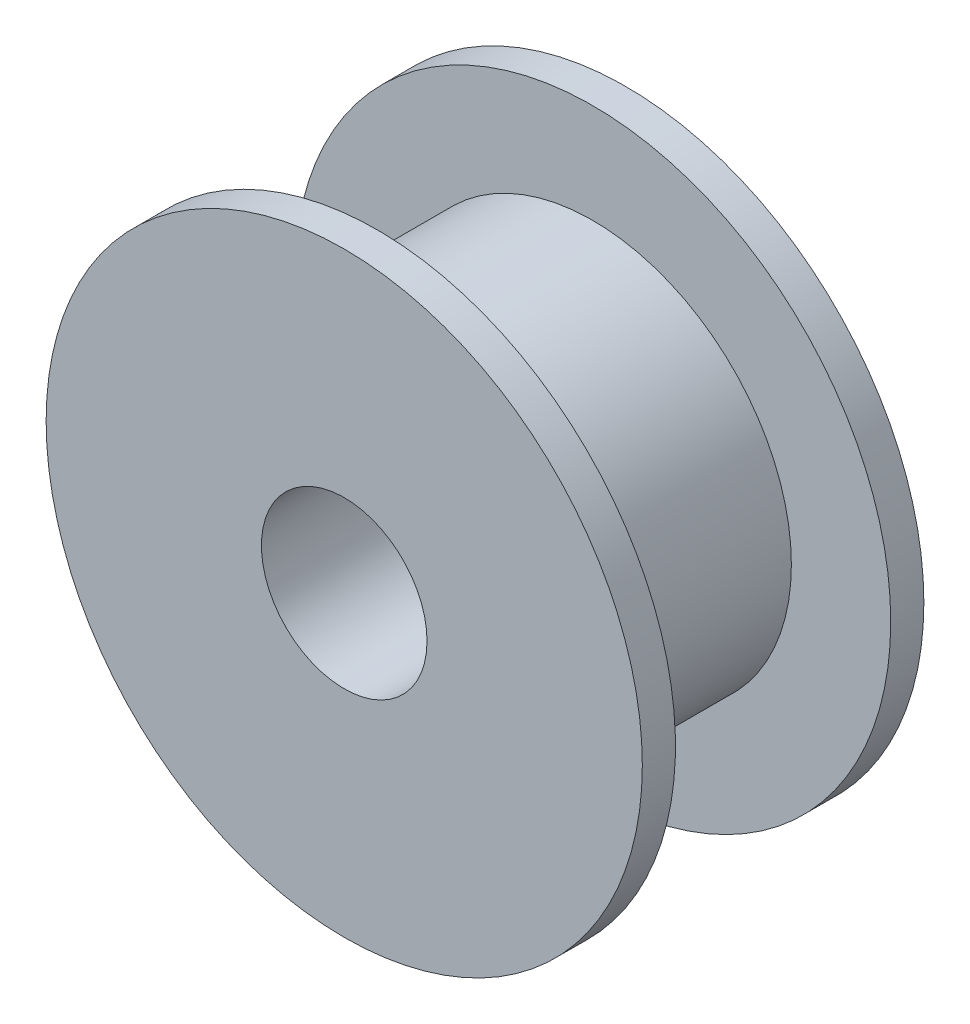
ISO-10303-21;
HEADER;
FILE_DESCRIPTION(('STEP AP214'),'2;1');
FILE_NAME('part.step','',(''),(''),'','','');
FILE_SCHEMA(('AUTOMOTIVE_DESIGN { 1 0 10303 214 1 1 1 1 }'));
ENDSEC;
DATA;
#1=APPLICATION_CONTEXT('core data for automotive mechanical design processes');
#2=APPLICATION_PROTOCOL_DEFINITION('international standard','automotive_design',2000,#1);
#3=PRODUCT_CONTEXT('',#1,'mechanical');
#4=PRODUCT('Part','Part','',(#3));
#5=PRODUCT_RELATED_PRODUCT_CATEGORY('part','',(#4));
#6=PRODUCT_DEFINITION_FORMATION('','',#4);
#7=PRODUCT_DEFINITION_CONTEXT('part definition',#1,'design');
#8=PRODUCT_DEFINITION('design','',#6,#7);
#9=PRODUCT_DEFINITION_SHAPE('','',#8);
#10=(LENGTH_UNIT() NAMED_UNIT(*) SI_UNIT(.MILLI.,.METRE.));
#11=(NAMED_UNIT(*) PLANE_ANGLE_UNIT() SI_UNIT($,.RADIAN.));
#12=(NAMED_UNIT(*) SI_UNIT($,.STERADIAN.) SOLID_ANGLE_UNIT());
#13=UNCERTAINTY_MEASURE_WITH_UNIT(LENGTH_MEASURE(1.E-05),#10,'distance_accuracy_value','');
#14=(GEOMETRIC_REPRESENTATION_CONTEXT(3) GLOBAL_UNCERTAINTY_ASSIGNED_CONTEXT((#13)) GLOBAL_UNIT_ASSIGNED_CONTEXT((#10,
#11,#12)) REPRESENTATION_CONTEXT('',''));
#15=CARTESIAN_POINT('',(0.,0.,0.));
#16=DIRECTION('',(0.,0.,1.));
#17=DIRECTION('',(1.,0.,0.));
#18=AXIS2_PLACEMENT_3D('',#15,#16,#17);
#19=CARTESIAN_POINT('',(0.,0.,8.5));
#20=DIRECTION('',(0.,0.,-1.));
#21=DIRECTION('',(-1.,0.,0.));
#22=AXIS2_PLACEMENT_3D('',#19,#20,#21);
#23=CYLINDRICAL_SURFACE('',#22,9.);
#24=CARTESIAN_POINT('',(0.,0.,0.));
#25=DIRECTION('',(0.,0.,1.));
#26=DIRECTION('',(1.,0.,0.));
#27=AXIS2_PLACEMENT_3D('',#24,#25,#26);
#28=CIRCLE('',#27,9.);
#29=CARTESIAN_POINT('',(9.,0.,0.));
#30=VERTEX_POINT('',#29);
#31=EDGE_CURVE('E38',#30,#30,#28,.T.);
#32=ORIENTED_EDGE('',*,*,#31,.T.);
#33=EDGE_LOOP('',(#32));
#34=FACE_BOUND('',#33,.T.);
#35=CARTESIAN_POINT('',(0.,0.,1.));
#36=DIRECTION('',(0.,0.,1.));
#37=DIRECTION('',(1.,0.,0.));
#38=AXIS2_PLACEMENT_3D('',#35,#36,#37);
#39=CIRCLE('',#38,9.);
#40=CARTESIAN_POINT('',(9.,0.,1.));
#41=VERTEX_POINT('',#40);
#42=EDGE_CURVE('E34',#41,#41,#39,.T.);
#43=ORIENTED_EDGE('',*,*,#42,.F.);
#44=EDGE_LOOP('',(#43));
#45=FACE_BOUND('',#44,.T.);
#46=ADVANCED_FACE('F31',(#34,#45),#23,.T.);
#47=CARTESIAN_POINT('',(0.,0.,8.5));
#48=DIRECTION('',(0.,0.,1.));
#49=DIRECTION('',(1.,0.,0.));
#50=AXIS2_PLACEMENT_3D('',#47,#48,#49);
#51=CIRCLE('',#50,9.);
#52=CARTESIAN_POINT('',(9.,0.,8.5));
#53=VERTEX_POINT('',#52);
#54=EDGE_CURVE('E10',#53,#53,#51,.T.);
#55=ORIENTED_EDGE('',*,*,#54,.F.);
#56=EDGE_LOOP('',(#55));
#57=FACE_BOUND('',#56,.T.);
#58=CARTESIAN_POINT('',(0.,0.,7.5));
#59=DIRECTION('',(0.,0.,-1.));
#60=DIRECTION('',(-1.,0.,0.));
#61=AXIS2_PLACEMENT_3D('',#58,#59,#60);
#62=CIRCLE('',#61,9.);
#63=CARTESIAN_POINT('',(-9.,0.,7.5));
#64=VERTEX_POINT('',#63);
#65=EDGE_CURVE('E48',#64,#64,#62,.T.);
#66=ORIENTED_EDGE('',*,*,#65,.F.);
#67=EDGE_LOOP('',(#66));
#68=FACE_BOUND('',#67,.T.);
#69=ADVANCED_FACE('F85',(#57,#68),#23,.T.);
#70=CARTESIAN_POINT('',(0.,0.,8.5));
#71=DIRECTION('',(0.,0.,1.));
#72=DIRECTION('',(1.,0.,0.));
#73=AXIS2_PLACEMENT_3D('',#70,#71,#72);
#74=PLANE('',#73);
#75=ORIENTED_EDGE('',*,*,#54,.T.);
#76=EDGE_LOOP('',(#75));
#77=FACE_BOUND('',#76,.T.);
#78=CARTESIAN_POINT('',(0.,0.,8.5));
#79=DIRECTION('',(0.,0.,1.));
#80=DIRECTION('',(1.,0.,0.));
#81=AXIS2_PLACEMENT_3D('',#78,#79,#80);
#82=CIRCLE('',#81,2.5);
#83=CARTESIAN_POINT('',(2.5,0.,8.5));
#84=VERTEX_POINT('',#83);
#85=EDGE_CURVE('E43',#84,#84,#82,.T.);
#86=ORIENTED_EDGE('',*,*,#85,.F.);
#87=EDGE_LOOP('',(#86));
#88=FACE_BOUND('',#87,.T.);
#89=ADVANCED_FACE('F80',(#77,#88),#74,.T.);
#90=CARTESIAN_POINT('',(0.,0.,0.));
#91=DIRECTION('',(0.,0.,1.));
#92=DIRECTION('',(1.,0.,0.));
#93=AXIS2_PLACEMENT_3D('',#90,#91,#92);
#94=PLANE('',#93);
#95=ORIENTED_EDGE('',*,*,#31,.F.);
#96=EDGE_LOOP('',(#95));
#97=FACE_BOUND('',#96,.T.);
#98=CARTESIAN_POINT('',(0.,0.,0.));
#99=DIRECTION('',(0.,0.,1.));
#100=DIRECTION('',(1.,0.,0.));
#101=AXIS2_PLACEMENT_3D('',#98,#99,#100);
#102=CIRCLE('',#101,2.5);
#103=CARTESIAN_POINT('',(2.5,0.,0.));
#104=VERTEX_POINT('',#103);
#105=EDGE_CURVE('E46',#104,#104,#102,.T.);
#106=ORIENTED_EDGE('',*,*,#105,.T.);
#107=EDGE_LOOP('',(#106));
#108=FACE_BOUND('',#107,.T.);
#109=ADVANCED_FACE('F67',(#97,#108),#94,.F.);
#110=CARTESIAN_POINT('',(0.,0.,8.5));
#111=DIRECTION('',(0.,0.,-1.));
#112=DIRECTION('',(-1.,0.,0.));
#113=AXIS2_PLACEMENT_3D('',#110,#111,#112);
#114=CYLINDRICAL_SURFACE('',#113,2.5);
#115=ORIENTED_EDGE('',*,*,#85,.T.);
#116=EDGE_LOOP('',(#115));
#117=FACE_BOUND('',#116,.T.);
#118=ORIENTED_EDGE('',*,*,#105,.F.);
#119=EDGE_LOOP('',(#118));
#120=FACE_BOUND('',#119,.T.);
#121=ADVANCED_FACE('F69',(#117,#120),#114,.F.);
#122=CARTESIAN_POINT('',(0.,6.,1.));
#123=DIRECTION('',(0.,0.,1.));
#124=DIRECTION('',(1.,0.,0.));
#125=AXIS2_PLACEMENT_3D('',#122,#123,#124);
#126=PLANE('',#125);
#127=CARTESIAN_POINT('',(0.,0.,1.));
#128=DIRECTION('',(0.,0.,1.));
#129=DIRECTION('',(1.,0.,0.));
#130=AXIS2_PLACEMENT_3D('',#127,#128,#129);
#131=CIRCLE('',#130,6.);
#132=CARTESIAN_POINT('',(6.,0.,1.));
#133=VERTEX_POINT('',#132);
#134=EDGE_CURVE('E50',#133,#133,#131,.T.);
#135=ORIENTED_EDGE('',*,*,#134,.F.);
#136=EDGE_LOOP('',(#135));
#137=FACE_BOUND('',#136,.T.);
#138=ORIENTED_EDGE('',*,*,#42,.T.);
#139=EDGE_LOOP('',(#138));
#140=FACE_BOUND('',#139,.T.);
#141=ADVANCED_FACE('F71',(#137,#140),#126,.T.);
#142=CARTESIAN_POINT('',(0.,9.78206445832345,7.5));
#143=DIRECTION('',(0.,0.,-1.));
#144=DIRECTION('',(-1.,0.,0.));
#145=AXIS2_PLACEMENT_3D('',#142,#143,#144);
#146=PLANE('',#145);
#147=CARTESIAN_POINT('',(0.,0.,7.5));
#148=DIRECTION('',(0.,0.,1.));
#149=DIRECTION('',(1.,0.,0.));
#150=AXIS2_PLACEMENT_3D('',#147,#148,#149);
#151=CIRCLE('',#150,6.);
#152=CARTESIAN_POINT('',(6.,0.,7.5));
#153=VERTEX_POINT('',#152);
#154=EDGE_CURVE('E55',#153,#153,#151,.T.);
#155=ORIENTED_EDGE('',*,*,#154,.T.);
#156=EDGE_LOOP('',(#155));
#157=FACE_BOUND('',#156,.T.);
#158=ORIENTED_EDGE('',*,*,#65,.T.);
#159=EDGE_LOOP('',(#158));
#160=FACE_BOUND('',#159,.T.);
#161=ADVANCED_FACE('F77',(#157,#160),#146,.T.);
#162=CARTESIAN_POINT('',(0.,0.,8.5));
#163=DIRECTION('',(0.,0.,1.));
#164=DIRECTION('',(1.,0.,0.));
#165=AXIS2_PLACEMENT_3D('',#162,#163,#164);
#166=CYLINDRICAL_SURFACE('',#165,6.);
#167=ORIENTED_EDGE('',*,*,#134,.T.);
#168=EDGE_LOOP('',(#167));
#169=FACE_BOUND('',#168,.T.);
#170=ORIENTED_EDGE('',*,*,#154,.F.);
#171=EDGE_LOOP('',(#170));
#172=FACE_BOUND('',#171,.T.);
#173=ADVANCED_FACE('F133',(#169,#172),#166,.T.);
#174=CLOSED_SHELL('',(#46,#69,#89,#109,#121,#141,#161,#173));
#175=MANIFOLD_SOLID_BREP('B2',#174);
#176=ADVANCED_BREP_SHAPE_REPRESENTATION('',(#18,#175),#14);
#177=SHAPE_DEFINITION_REPRESENTATION(#9,#176);
ENDSEC;
END-ISO-10303-21;
